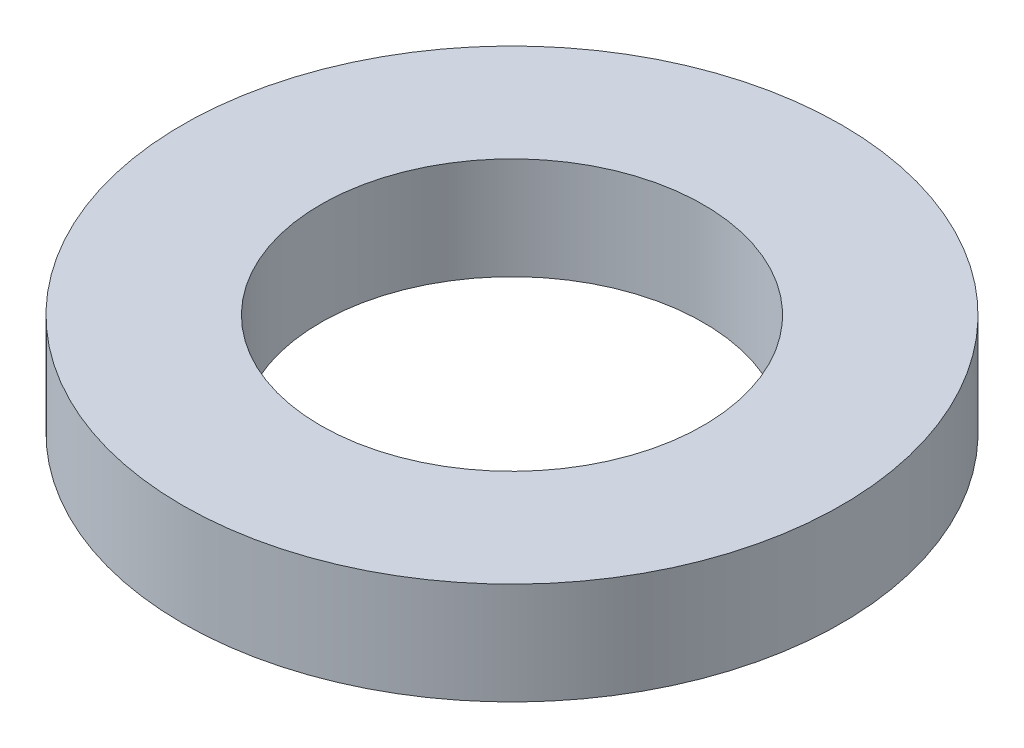
ISO-10303-21;
HEADER;
FILE_DESCRIPTION(('STEP AP214'),'2;1');
FILE_NAME('part.step','',(''),(''),'','','');
FILE_SCHEMA(('AUTOMOTIVE_DESIGN { 1 0 10303 214 1 1 1 1 }'));
ENDSEC;
DATA;
#1=APPLICATION_CONTEXT('core data for automotive mechanical design processes');
#2=APPLICATION_PROTOCOL_DEFINITION('international standard','automotive_design',2000,#1);
#3=PRODUCT_CONTEXT('',#1,'mechanical');
#4=PRODUCT('Part','Part','',(#3));
#5=PRODUCT_RELATED_PRODUCT_CATEGORY('part','',(#4));
#6=PRODUCT_DEFINITION_FORMATION('','',#4);
#7=PRODUCT_DEFINITION_CONTEXT('part definition',#1,'design');
#8=PRODUCT_DEFINITION('design','',#6,#7);
#9=PRODUCT_DEFINITION_SHAPE('','',#8);
#10=(LENGTH_UNIT() NAMED_UNIT(*) SI_UNIT(.MILLI.,.METRE.));
#11=(NAMED_UNIT(*) PLANE_ANGLE_UNIT() SI_UNIT($,.RADIAN.));
#12=(NAMED_UNIT(*) SI_UNIT($,.STERADIAN.) SOLID_ANGLE_UNIT());
#13=UNCERTAINTY_MEASURE_WITH_UNIT(LENGTH_MEASURE(1.E-05),#10,'distance_accuracy_value','');
#14=(GEOMETRIC_REPRESENTATION_CONTEXT(3) GLOBAL_UNCERTAINTY_ASSIGNED_CONTEXT((#13)) GLOBAL_UNIT_ASSIGNED_CONTEXT((#10,
#11,#12)) REPRESENTATION_CONTEXT('',''));
#15=CARTESIAN_POINT('',(0.,0.,0.));
#16=DIRECTION('',(0.,0.,1.));
#17=DIRECTION('',(1.,0.,0.));
#18=AXIS2_PLACEMENT_3D('',#15,#16,#17);
#19=CARTESIAN_POINT('',(0.,24.,0.));
#20=DIRECTION('',(0.,-1.,0.));
#21=DIRECTION('',(0.,0.,-1.));
#22=AXIS2_PLACEMENT_3D('',#19,#20,#21);
#23=CYLINDRICAL_SURFACE('',#22,77.5);
#24=CARTESIAN_POINT('',(0.,24.,0.));
#25=DIRECTION('',(0.,1.,0.));
#26=DIRECTION('',(0.,0.,1.));
#27=AXIS2_PLACEMENT_3D('',#24,#25,#26);
#28=CIRCLE('',#27,77.5);
#29=CARTESIAN_POINT('',(0.,24.,77.5));
#30=VERTEX_POINT('',#29);
#31=EDGE_CURVE('E10',#30,#30,#28,.T.);
#32=ORIENTED_EDGE('',*,*,#31,.F.);
#33=EDGE_LOOP('',(#32));
#34=FACE_BOUND('',#33,.T.);
#35=CARTESIAN_POINT('',(0.,0.,0.));
#36=DIRECTION('',(0.,1.,0.));
#37=DIRECTION('',(0.,0.,1.));
#38=AXIS2_PLACEMENT_3D('',#35,#36,#37);
#39=CIRCLE('',#38,77.5);
#40=CARTESIAN_POINT('',(0.,0.,77.5));
#41=VERTEX_POINT('',#40);
#42=EDGE_CURVE('E37',#41,#41,#39,.T.);
#43=ORIENTED_EDGE('',*,*,#42,.T.);
#44=EDGE_LOOP('',(#43));
#45=FACE_BOUND('',#44,.T.);
#46=ADVANCED_FACE('F40',(#34,#45),#23,.T.);
#47=CARTESIAN_POINT('',(0.,24.,0.));
#48=DIRECTION('',(0.,1.,0.));
#49=DIRECTION('',(0.,0.,1.));
#50=AXIS2_PLACEMENT_3D('',#47,#48,#49);
#51=PLANE('',#50);
#52=CARTESIAN_POINT('',(0.,24.,0.));
#53=DIRECTION('',(0.,1.,0.));
#54=DIRECTION('',(0.,0.,1.));
#55=AXIS2_PLACEMENT_3D('',#52,#53,#54);
#56=CIRCLE('',#55,45.);
#57=CARTESIAN_POINT('',(0.,24.,45.));
#58=VERTEX_POINT('',#57);
#59=EDGE_CURVE('E50',#58,#58,#56,.T.);
#60=ORIENTED_EDGE('',*,*,#59,.F.);
#61=EDGE_LOOP('',(#60));
#62=FACE_BOUND('',#61,.T.);
#63=ORIENTED_EDGE('',*,*,#31,.T.);
#64=EDGE_LOOP('',(#63));
#65=FACE_BOUND('',#64,.T.);
#66=ADVANCED_FACE('F59',(#62,#65),#51,.T.);
#67=CARTESIAN_POINT('',(0.,0.,0.));
#68=DIRECTION('',(0.,1.,0.));
#69=DIRECTION('',(0.,0.,1.));
#70=AXIS2_PLACEMENT_3D('',#67,#68,#69);
#71=PLANE('',#70);
#72=CARTESIAN_POINT('',(0.,0.,0.));
#73=DIRECTION('',(0.,1.,0.));
#74=DIRECTION('',(0.,0.,1.));
#75=AXIS2_PLACEMENT_3D('',#72,#73,#74);
#76=CIRCLE('',#75,45.);
#77=CARTESIAN_POINT('',(0.,0.,45.));
#78=VERTEX_POINT('',#77);
#79=EDGE_CURVE('E47',#78,#78,#76,.T.);
#80=ORIENTED_EDGE('',*,*,#79,.T.);
#81=EDGE_LOOP('',(#80));
#82=FACE_BOUND('',#81,.T.);
#83=ORIENTED_EDGE('',*,*,#42,.F.);
#84=EDGE_LOOP('',(#83));
#85=FACE_BOUND('',#84,.T.);
#86=ADVANCED_FACE('F58',(#82,#85),#71,.F.);
#87=CARTESIAN_POINT('',(0.,24.,0.));
#88=DIRECTION('',(0.,-1.,0.));
#89=DIRECTION('',(0.,0.,-1.));
#90=AXIS2_PLACEMENT_3D('',#87,#88,#89);
#91=CYLINDRICAL_SURFACE('',#90,45.);
#92=ORIENTED_EDGE('',*,*,#59,.T.);
#93=EDGE_LOOP('',(#92));
#94=FACE_BOUND('',#93,.T.);
#95=ORIENTED_EDGE('',*,*,#79,.F.);
#96=EDGE_LOOP('',(#95));
#97=FACE_BOUND('',#96,.T.);
#98=ADVANCED_FACE('F54',(#94,#97),#91,.F.);
#99=CLOSED_SHELL('',(#46,#66,#86,#98));
#100=MANIFOLD_SOLID_BREP('B2',#99);
#101=ADVANCED_BREP_SHAPE_REPRESENTATION('',(#18,#100),#14);
#102=SHAPE_DEFINITION_REPRESENTATION(#9,#101);
ENDSEC;
END-ISO-10303-21;
